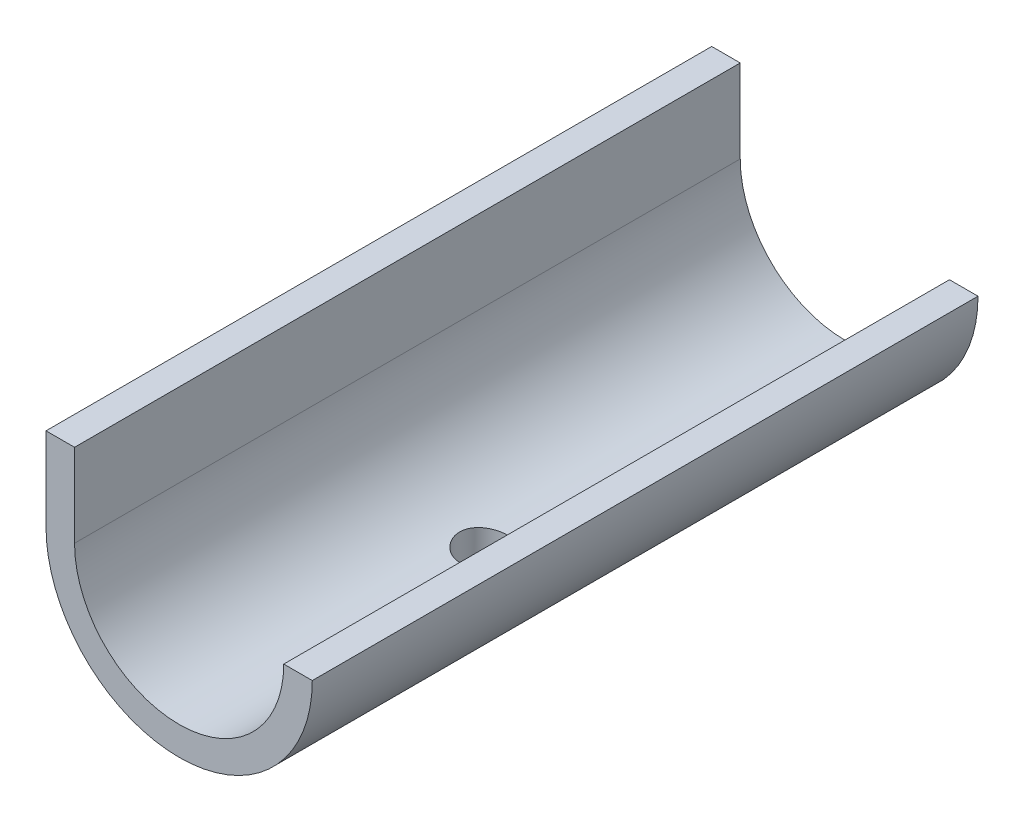
ISO-10303-21;
HEADER;
FILE_DESCRIPTION(('STEP AP214'),'2;1');
FILE_NAME('part.step','',(''),(''),'','','');
FILE_SCHEMA(('AUTOMOTIVE_DESIGN { 1 0 10303 214 1 1 1 1 }'));
ENDSEC;
DATA;
#1=APPLICATION_CONTEXT('core data for automotive mechanical design processes');
#2=APPLICATION_PROTOCOL_DEFINITION('international standard','automotive_design',2000,#1);
#3=PRODUCT_CONTEXT('',#1,'mechanical');
#4=PRODUCT('Part','Part','',(#3));
#5=PRODUCT_RELATED_PRODUCT_CATEGORY('part','',(#4));
#6=PRODUCT_DEFINITION_FORMATION('','',#4);
#7=PRODUCT_DEFINITION_CONTEXT('part definition',#1,'design');
#8=PRODUCT_DEFINITION('design','',#6,#7);
#9=PRODUCT_DEFINITION_SHAPE('','',#8);
#10=(LENGTH_UNIT() NAMED_UNIT(*) SI_UNIT(.MILLI.,.METRE.));
#11=(NAMED_UNIT(*) PLANE_ANGLE_UNIT() SI_UNIT($,.RADIAN.));
#12=(NAMED_UNIT(*) SI_UNIT($,.STERADIAN.) SOLID_ANGLE_UNIT());
#13=UNCERTAINTY_MEASURE_WITH_UNIT(LENGTH_MEASURE(1.E-05),#10,'distance_accuracy_value','');
#14=(GEOMETRIC_REPRESENTATION_CONTEXT(3) GLOBAL_UNCERTAINTY_ASSIGNED_CONTEXT((#13)) GLOBAL_UNIT_ASSIGNED_CONTEXT((#10,
#11,#12)) REPRESENTATION_CONTEXT('',''));
#15=CARTESIAN_POINT('',(0.,0.,0.));
#16=DIRECTION('',(0.,0.,1.));
#17=DIRECTION('',(1.,0.,0.));
#18=AXIS2_PLACEMENT_3D('',#15,#16,#17);
#19=CARTESIAN_POINT('',(0.,0.,70.));
#20=DIRECTION('',(0.,0.,-1.));
#21=DIRECTION('',(-1.,0.,0.));
#22=AXIS2_PLACEMENT_3D('',#19,#20,#21);
#23=CYLINDRICAL_SURFACE('',#22,14.);
#24=CARTESIAN_POINT('',(0.,-14.,40.5));
#25=CARTESIAN_POINT('',(0.139239584884693,-13.9999975279519,40.4999945573978));
#26=CARTESIAN_POINT('',(0.278551398798769,-13.9979012185717,40.4883280975497));
#27=CARTESIAN_POINT('',(0.553257461551452,-13.9897405917584,40.4419958336177));
#28=CARTESIAN_POINT('',(0.688648164109868,-13.9836727927304,40.4073098491621));
#29=CARTESIAN_POINT('',(0.951498716003348,-13.9682487550673,40.316027766762));
#30=CARTESIAN_POINT('',(1.07896532023463,-13.9588953637627,40.2594506356316));
#31=CARTESIAN_POINT('',(1.32258294398845,-13.9379246329878,40.1260443117829));
#32=CARTESIAN_POINT('',(1.43873504418376,-13.9263075100501,40.0492170558005));
#33=CARTESIAN_POINT('',(1.65770744324836,-13.9019523246795,39.8766007869825));
#34=CARTESIAN_POINT('',(1.76038642030699,-13.8892044205267,39.7806338701291));
#35=CARTESIAN_POINT('',(1.94827611327337,-13.8640984861177,39.5728452504625));
#36=CARTESIAN_POINT('',(2.03348564380398,-13.851740482366,39.4610224726311));
#37=CARTESIAN_POINT('',(2.18459604528548,-13.828718102426,39.2237098828865));
#38=CARTESIAN_POINT('',(2.2503549193704,-13.8180664295287,39.098128313076));
#39=CARTESIAN_POINT('',(2.35978878168925,-13.799800524336,38.8374788413355));
#40=CARTESIAN_POINT('',(2.40346549014524,-13.7921860554493,38.7024116792762));
#41=CARTESIAN_POINT('',(2.46704527057167,-13.7809553111512,38.4281311785852));
#42=CARTESIAN_POINT('',(2.48719373563912,-13.7772977959189,38.2889764448584));
#43=CARTESIAN_POINT('',(2.50390640595675,-13.7742705702387,38.0092170779927));
#44=CARTESIAN_POINT('',(2.5004725277955,-13.7749005113397,37.8686125636079));
#45=CARTESIAN_POINT('',(2.47031736473549,-13.78033942777,37.5917111025635));
#46=CARTESIAN_POINT('',(2.44387361595034,-13.7850985960022,37.4553828097458));
#47=CARTESIAN_POINT('',(2.3688857538611,-13.7981816164894,37.1891293635014));
#48=CARTESIAN_POINT('',(2.3203407810603,-13.8065056073765,37.0592044593146));
#49=CARTESIAN_POINT('',(2.2022526779638,-13.8258332062344,36.8086255211308));
#50=CARTESIAN_POINT('',(2.13259607876041,-13.836851230427,36.6880261183911));
#51=CARTESIAN_POINT('',(1.97434240206301,-13.8603157063341,36.4601224977845));
#52=CARTESIAN_POINT('',(1.8857435758047,-13.8727622898853,36.3528195089008));
#53=CARTESIAN_POINT('',(1.69061708906588,-13.8978993100277,36.1529497822127));
#54=CARTESIAN_POINT('',(1.58385171151662,-13.9105906924877,36.0606150820204));
#55=CARTESIAN_POINT('',(1.35622200140277,-13.934623736005,35.895133867092));
#56=CARTESIAN_POINT('',(1.23535755129116,-13.9459653858077,35.8219875123497));
#57=CARTESIAN_POINT('',(0.98272912541029,-13.9660408385903,35.6969309763037));
#58=CARTESIAN_POINT('',(0.850953766692503,-13.9747718731006,35.6450433177021));
#59=CARTESIAN_POINT('',(0.58036740103594,-13.9886206199705,35.564203117808));
#60=CARTESIAN_POINT('',(0.441557072364819,-13.9937386799627,35.5352483699271));
#61=CARTESIAN_POINT('',(0.162838985381711,-13.999737506353,35.501415153955));
#62=CARTESIAN_POINT('',(0.0229710170574318,-14.0006742692249,35.4962184914519));
#63=CARTESIAN_POINT('',(-0.255635962261019,-13.9983590537919,35.5091977397633));
#64=CARTESIAN_POINT('',(-0.394375023096462,-13.9951072614327,35.5273726130279));
#65=CARTESIAN_POINT('',(-0.665788309880041,-13.9848150834562,35.5863143984903));
#66=CARTESIAN_POINT('',(-0.798498270193177,-13.9778014506051,35.6269218392178));
#67=CARTESIAN_POINT('',(-1.05522666669471,-13.960768732277,35.7294046301854));
#68=CARTESIAN_POINT('',(-1.17924455600831,-13.9507494579045,35.7912813171688));
#69=CARTESIAN_POINT('',(-1.4164370995142,-13.9286773386827,35.9352612229124));
#70=CARTESIAN_POINT('',(-1.52949072853056,-13.9166051337771,36.0175607915398));
#71=CARTESIAN_POINT('',(-1.74029662989027,-13.8918196803142,36.1997826510615));
#72=CARTESIAN_POINT('',(-1.8380476135904,-13.8791063778887,36.2997064245934));
#73=CARTESIAN_POINT('',(-2.01666949257316,-13.8542878912599,36.5157749692476));
#74=CARTESIAN_POINT('',(-2.09732417121668,-13.8421918152179,36.6320997008671));
#75=CARTESIAN_POINT('',(-2.237948270774,-13.8201546664427,36.8768336894488));
#76=CARTESIAN_POINT('',(-2.29791841370414,-13.8102135184939,37.0052425244028));
#77=CARTESIAN_POINT('',(-2.39515706197428,-13.7936819036385,37.2699261748407));
#78=CARTESIAN_POINT('',(-2.43252842924636,-13.7870762776017,37.4061622108181));
#79=CARTESIAN_POINT('',(-2.48382895891452,-13.7779274424092,37.6831072951462));
#80=CARTESIAN_POINT('',(-2.49776049425864,-13.7753838220348,37.8238158892447));
#81=CARTESIAN_POINT('',(-2.50171229780527,-13.7746664843416,38.1035492089015));
#82=CARTESIAN_POINT('',(-2.49207328035334,-13.7764304992774,38.2425690771419));
#83=CARTESIAN_POINT('',(-2.44989946243099,-13.7839923104721,38.5169738180181));
#84=CARTESIAN_POINT('',(-2.41736476961371,-13.7897900877646,38.6523587077421));
#85=CARTESIAN_POINT('',(-2.3304611386535,-13.8047410588042,38.9154898760334));
#86=CARTESIAN_POINT('',(-2.27612576514716,-13.8138890925692,39.0432475517861));
#87=CARTESIAN_POINT('',(-2.14719934056736,-13.8345140264404,39.2878884394367));
#88=CARTESIAN_POINT('',(-2.07260704454505,-13.8459910696717,39.4047709823784));
#89=CARTESIAN_POINT('',(-1.90408567428783,-13.8701759776461,39.62605704739));
#90=CARTESIAN_POINT('',(-1.80990741155503,-13.8828984590281,39.7302692317432));
#91=CARTESIAN_POINT('',(-1.60540999726032,-13.9080282435319,39.9215258059662));
#92=CARTESIAN_POINT('',(-1.49508713803928,-13.920435473485,40.0085662414773));
#93=CARTESIAN_POINT('',(-1.26037074660264,-13.9436534678806,40.1636577677888));
#94=CARTESIAN_POINT('',(-1.13587103767058,-13.9544505684285,40.2315502593916));
#95=CARTESIAN_POINT('',(-0.87708484019048,-13.9730987112511,40.3453492032927));
#96=CARTESIAN_POINT('',(-0.742807935956544,-13.9809525934581,40.3912768614976));
#97=CARTESIAN_POINT('',(-0.50673175549175,-13.9911779735748,40.4502306133961));
#98=CARTESIAN_POINT('',(-0.406334867671671,-13.9944679971863,40.4688631369367));
#99=CARTESIAN_POINT('',(-0.20397155203894,-13.9988798925243,40.4937496904037));
#100=CARTESIAN_POINT('',(-0.102005158109662,-14.0000018109911,40.5000039871815));
#101=CARTESIAN_POINT('',(0.,-14.,40.5));
#102=B_SPLINE_CURVE_WITH_KNOTS('',3,(#24,#25,#26,#27,#28,#29,#30,#31,#32,#33,#34,#35,#36,#37,
#38,#39,#40,#41,#42,#43,#44,#45,#46,#47,#48,#49,#50,#51,#52,#53,#54,#55,#56,#57,#58,#59,#60,#61,
#62,#63,#64,#65,#66,#67,#68,#69,#70,#71,#72,#73,#74,#75,#76,#77,#78,#79,#80,#81,#82,#83,#84,#85,
#86,#87,#88,#89,#90,#91,#92,#93,#94,#95,#96,#97,#98,#99,#100,#101),.UNSPECIFIED.,.T.,.F.,(4,2,2,
2,2,2,2,2,2,2,2,2,2,2,2,2,2,2,2,2,2,2,2,2,2,2,2,2,2,2,2,2,2,2,2,2,2,2,4),(0.,0.417345796741632,
0.835057949374028,1.25240899749005,1.66972014433903,2.09110796789027,2.51252437496281,
2.93694536469338,3.36133328652202,3.78125426758826,4.20114112116258,4.61603258426602,
5.03094018350355,5.44811857395105,5.86533549534551,6.28850377891476,6.71167559078143,
7.13529458336168,7.55887281066885,7.97676106621615,8.39463077078322,8.80956740145244,
9.22453011509512,9.64364840488133,10.062801969859,10.4869762077789,10.9111356379344,
11.3333496148672,11.7555208460958,12.1716257235315,12.5877286444974,13.0031933708605,
13.4186836366131,13.8398246877353,14.2610626074926,14.6856934454013,15.109913492521,
15.4156623340469,15.7214045841282),.UNSPECIFIED.);
#103=CARTESIAN_POINT('',(0.,-14.,40.5));
#104=VERTEX_POINT('',#103);
#105=EDGE_CURVE('E119',#104,#104,#102,.T.);
#106=ORIENTED_EDGE('',*,*,#105,.T.);
#107=EDGE_LOOP('',(#106));
#108=FACE_BOUND('',#107,.T.);
#109=CARTESIAN_POINT('',(0.,0.,70.));
#110=DIRECTION('',(0.,0.,1.));
#111=DIRECTION('',(1.,0.,0.));
#112=AXIS2_PLACEMENT_3D('',#109,#110,#111);
#113=CIRCLE('',#112,14.);
#114=CARTESIAN_POINT('',(-14.,0.,70.));
#115=VERTEX_POINT('',#114);
#116=CARTESIAN_POINT('',(14.,0.,70.));
#117=VERTEX_POINT('',#116);
#118=EDGE_CURVE('E141',#115,#117,#113,.T.);
#119=ORIENTED_EDGE('',*,*,#118,.F.);
#120=DIRECTION('',(0.,0.,-1.));
#121=VECTOR('',#120,1.);
#122=CARTESIAN_POINT('',(-14.,0.,70.));
#123=LINE('',#122,#121);
#124=CARTESIAN_POINT('',(-14.,0.,0.));
#125=VERTEX_POINT('',#124);
#126=EDGE_CURVE('E133',#115,#125,#123,.T.);
#127=ORIENTED_EDGE('',*,*,#126,.T.);
#128=CARTESIAN_POINT('',(0.,0.,0.));
#129=DIRECTION('',(0.,0.,1.));
#130=DIRECTION('',(1.,0.,0.));
#131=AXIS2_PLACEMENT_3D('',#128,#129,#130);
#132=CIRCLE('',#131,14.);
#133=CARTESIAN_POINT('',(14.,0.,0.));
#134=VERTEX_POINT('',#133);
#135=EDGE_CURVE('E111',#125,#134,#132,.T.);
#136=ORIENTED_EDGE('',*,*,#135,.T.);
#137=DIRECTION('',(0.,0.,-1.));
#138=VECTOR('',#137,1.);
#139=CARTESIAN_POINT('',(14.,0.,70.));
#140=LINE('',#139,#138);
#141=EDGE_CURVE('E58',#134,#117,#140,.F.);
#142=ORIENTED_EDGE('',*,*,#141,.T.);
#143=EDGE_LOOP('',(#119,#127,#136,#142));
#144=FACE_BOUND('',#143,.T.);
#145=ADVANCED_FACE('F33',(#108,#144),#23,.T.);
#146=CARTESIAN_POINT('',(0.,0.,70.));
#147=DIRECTION('',(0.,0.,1.));
#148=DIRECTION('',(1.,0.,0.));
#149=AXIS2_PLACEMENT_3D('',#146,#147,#148);
#150=PLANE('',#149);
#151=CARTESIAN_POINT('',(0.,0.,70.));
#152=DIRECTION('',(0.,0.,1.));
#153=DIRECTION('',(1.,0.,0.));
#154=AXIS2_PLACEMENT_3D('',#151,#152,#153);
#155=CIRCLE('',#154,11.);
#156=CARTESIAN_POINT('',(-11.,0.,70.));
#157=VERTEX_POINT('',#156);
#158=CARTESIAN_POINT('',(11.,0.,70.));
#159=VERTEX_POINT('',#158);
#160=EDGE_CURVE('E135',#157,#159,#155,.T.);
#161=ORIENTED_EDGE('',*,*,#160,.F.);
#162=DIRECTION('',(0.,1.,0.));
#163=VECTOR('',#162,1.);
#164=CARTESIAN_POINT('',(-11.,0.,70.));
#165=LINE('',#164,#163);
#166=CARTESIAN_POINT('',(-11.,8.74076907527716,70.));
#167=VERTEX_POINT('',#166);
#168=EDGE_CURVE('E114',#157,#167,#165,.T.);
#169=ORIENTED_EDGE('',*,*,#168,.T.);
#170=DIRECTION('',(-1.,0.,0.));
#171=VECTOR('',#170,1.);
#172=CARTESIAN_POINT('',(-11.,8.74076907527716,70.));
#173=LINE('',#172,#171);
#174=CARTESIAN_POINT('',(-14.,8.74076907527716,70.));
#175=VERTEX_POINT('',#174);
#176=EDGE_CURVE('E125',#167,#175,#173,.T.);
#177=ORIENTED_EDGE('',*,*,#176,.T.);
#178=DIRECTION('',(0.,-1.,0.));
#179=VECTOR('',#178,1.);
#180=CARTESIAN_POINT('',(-14.,8.74076907527716,70.));
#181=LINE('',#180,#179);
#182=EDGE_CURVE('E95',#175,#115,#181,.T.);
#183=ORIENTED_EDGE('',*,*,#182,.T.);
#184=ORIENTED_EDGE('',*,*,#118,.T.);
#185=DIRECTION('',(1.,0.,0.));
#186=VECTOR('',#185,1.);
#187=CARTESIAN_POINT('',(-16.0293682697394,0.,70.));
#188=LINE('',#187,#186);
#189=EDGE_CURVE('E128',#159,#117,#188,.T.);
#190=ORIENTED_EDGE('',*,*,#189,.F.);
#191=EDGE_LOOP('',(#161,#169,#177,#183,#184,#190));
#192=FACE_BOUND('',#191,.T.);
#193=ADVANCED_FACE('F153',(#192),#150,.T.);
#194=CARTESIAN_POINT('',(0.,0.,0.));
#195=DIRECTION('',(0.,0.,1.));
#196=DIRECTION('',(1.,0.,0.));
#197=AXIS2_PLACEMENT_3D('',#194,#195,#196);
#198=PLANE('',#197);
#199=ORIENTED_EDGE('',*,*,#135,.F.);
#200=DIRECTION('',(0.,-1.,0.));
#201=VECTOR('',#200,1.);
#202=CARTESIAN_POINT('',(-14.,8.74076907527716,0.));
#203=LINE('',#202,#201);
#204=CARTESIAN_POINT('',(-14.,8.74076907527716,0.));
#205=VERTEX_POINT('',#204);
#206=EDGE_CURVE('E93',#205,#125,#203,.T.);
#207=ORIENTED_EDGE('',*,*,#206,.F.);
#208=DIRECTION('',(-1.,0.,0.));
#209=VECTOR('',#208,1.);
#210=CARTESIAN_POINT('',(-11.,8.74076907527716,0.));
#211=LINE('',#210,#209);
#212=CARTESIAN_POINT('',(-11.,8.74076907527716,0.));
#213=VERTEX_POINT('',#212);
#214=EDGE_CURVE('E108',#213,#205,#211,.T.);
#215=ORIENTED_EDGE('',*,*,#214,.F.);
#216=DIRECTION('',(0.,1.,0.));
#217=VECTOR('',#216,1.);
#218=CARTESIAN_POINT('',(-11.,0.,0.));
#219=LINE('',#218,#217);
#220=CARTESIAN_POINT('',(-11.,0.,0.));
#221=VERTEX_POINT('',#220);
#222=EDGE_CURVE('E101',#221,#213,#219,.T.);
#223=ORIENTED_EDGE('',*,*,#222,.F.);
#224=CARTESIAN_POINT('',(0.,0.,0.));
#225=DIRECTION('',(0.,0.,1.));
#226=DIRECTION('',(1.,0.,0.));
#227=AXIS2_PLACEMENT_3D('',#224,#225,#226);
#228=CIRCLE('',#227,11.);
#229=CARTESIAN_POINT('',(11.,0.,0.));
#230=VERTEX_POINT('',#229);
#231=EDGE_CURVE('E136',#221,#230,#228,.T.);
#232=ORIENTED_EDGE('',*,*,#231,.T.);
#233=DIRECTION('',(1.,0.,0.));
#234=VECTOR('',#233,1.);
#235=CARTESIAN_POINT('',(-16.0293682697394,0.,0.));
#236=LINE('',#235,#234);
#237=EDGE_CURVE('E54',#230,#134,#236,.T.);
#238=ORIENTED_EDGE('',*,*,#237,.T.);
#239=EDGE_LOOP('',(#199,#207,#215,#223,#232,#238));
#240=FACE_BOUND('',#239,.T.);
#241=ADVANCED_FACE('F106',(#240),#198,.F.);
#242=CARTESIAN_POINT('',(0.,0.,0.));
#243=DIRECTION('',(0.,0.,1.));
#244=DIRECTION('',(1.,0.,0.));
#245=AXIS2_PLACEMENT_3D('',#242,#243,#244);
#246=CYLINDRICAL_SURFACE('',#245,11.);
#247=CARTESIAN_POINT('',(0.,-11.,40.5));
#248=CARTESIAN_POINT('',(-0.138518278596905,-10.9999974735185,40.4999954681736));
#249=CARTESIAN_POINT('',(-0.27709017225801,-10.9973570934613,40.4884487724231));
#250=CARTESIAN_POINT('',(-0.550288594599325,-10.987079320306,40.4426205239383));
#251=CARTESIAN_POINT('',(-0.684912392220731,-10.9794385496265,40.4083236040447));
#252=CARTESIAN_POINT('',(-0.946227671984919,-10.9600095312294,40.3181319513681));
#253=CARTESIAN_POINT('',(-1.07292759495648,-10.9482257885674,40.2622606720193));
#254=CARTESIAN_POINT('',(-1.31515227582567,-10.921778201627,40.1305828866191));
#255=CARTESIAN_POINT('',(-1.43067714503183,-10.9071143860398,40.0547765791576));
#256=CARTESIAN_POINT('',(-1.64926760444638,-10.8762265816814,39.8839979553933));
#257=CARTESIAN_POINT('',(-1.75211293892049,-10.8599819758326,39.788747426525));
#258=CARTESIAN_POINT('',(-1.94051389816611,-10.827906511833,39.5823810258628));
#259=CARTESIAN_POINT('',(-2.02606788121784,-10.8120756930933,39.4712636493055));
#260=CARTESIAN_POINT('',(-2.17844599401787,-10.7824158369221,39.2346679447163));
#261=CARTESIAN_POINT('',(-2.24503254356576,-10.7686131580577,39.1090330036942));
#262=CARTESIAN_POINT('',(-2.3560606971787,-10.7448696147509,38.8479904994184));
#263=CARTESIAN_POINT('',(-2.40050517717749,-10.7349282488168,38.7125842079384));
#264=CARTESIAN_POINT('',(-2.46525349412719,-10.7202434469831,38.4382408128835));
#265=CARTESIAN_POINT('',(-2.48594892680754,-10.715415797339,38.2994007368775));
#266=CARTESIAN_POINT('',(-2.50382988451487,-10.7112523406768,38.0201417727869));
#267=CARTESIAN_POINT('',(-2.50101853886553,-10.711915802658,37.8797230973377));
#268=CARTESIAN_POINT('',(-2.47228016958763,-10.7185835035919,37.6042271166513));
#269=CARTESIAN_POINT('',(-2.44681104599438,-10.7244819412976,37.4690990938051));
#270=CARTESIAN_POINT('',(-2.37420684920502,-10.7407873672743,37.2050855138452));
#271=CARTESIAN_POINT('',(-2.32707047404289,-10.7511946264744,37.0762003323728));
#272=CARTESIAN_POINT('',(-2.21205734402544,-10.7754474384537,36.8270593281895));
#273=CARTESIAN_POINT('',(-2.14400712086008,-10.7893215597825,36.7068864822363));
#274=CARTESIAN_POINT('',(-1.98921977920408,-10.8189276843241,36.4794974468889));
#275=CARTESIAN_POINT('',(-1.90247992237135,-10.8346599596346,36.3722831597361));
#276=CARTESIAN_POINT('',(-1.71036518003517,-10.8666615287251,36.171221438179));
#277=CARTESIAN_POINT('',(-1.60460166742828,-10.882934773515,36.0777455734836));
#278=CARTESIAN_POINT('',(-1.37871229840972,-10.9138502597158,35.9097941112929));
#279=CARTESIAN_POINT('',(-1.2585861400908,-10.9284924668293,35.8353189133005));
#280=CARTESIAN_POINT('',(-1.00690799179915,-10.9545497424637,35.7073796120285));
#281=CARTESIAN_POINT('',(-0.875328834348157,-10.9659568484873,35.6539672263777));
#282=CARTESIAN_POINT('',(-0.604745122491697,-10.9841998956698,35.5701159941321));
#283=CARTESIAN_POINT('',(-0.465741739663719,-10.9910365557784,35.5396735341778));
#284=CARTESIAN_POINT('',(-0.187439840192731,-10.9992650071756,35.5031737625273));
#285=CARTESIAN_POINT('',(-0.0482110923370365,-11.0007700184113,35.4966093086833));
#286=CARTESIAN_POINT('',(0.229353886680105,-10.9984842255063,35.5066730398529));
#287=CARTESIAN_POINT('',(0.36769018272086,-10.9946938107912,35.523299519406));
#288=CARTESIAN_POINT('',(0.637841677218462,-10.9823148103741,35.5788531669054));
#289=CARTESIAN_POINT('',(0.76971503681443,-10.973784087055,35.6175115464437));
#290=CARTESIAN_POINT('',(1.02510393087761,-10.9528806132367,35.7157310274571));
#291=CARTESIAN_POINT('',(1.14861871432289,-10.9405075180554,35.7752940042533));
#292=CARTESIAN_POINT('',(1.38586085256056,-10.9130143275095,35.9146691435553));
#293=CARTESIAN_POINT('',(1.4994106852272,-10.8978552985532,35.9947756267732));
#294=CARTESIAN_POINT('',(1.71163773579052,-10.866546095646,36.1725793284402));
#295=CARTESIAN_POINT('',(1.8103128535797,-10.8503957821912,36.2702790265468));
#296=CARTESIAN_POINT('',(1.99201706218096,-10.8185287714487,36.4828309651334));
#297=CARTESIAN_POINT('',(2.07469366594062,-10.8028272119253,36.5979872417868));
#298=CARTESIAN_POINT('',(2.21953814406553,-10.7740023321604,36.8408463906703));
#299=CARTESIAN_POINT('',(2.28170692501017,-10.7608788979592,36.9685487079596));
#300=CARTESIAN_POINT('',(2.38333597241928,-10.7388274870674,37.2321804695689));
#301=CARTESIAN_POINT('',(2.42292716221705,-10.7298753781702,37.3680573237434));
#302=CARTESIAN_POINT('',(2.47865258340365,-10.7171411058581,37.6447669066991));
#303=CARTESIAN_POINT('',(2.49479091341614,-10.7133580391079,37.7855987651364));
#304=CARTESIAN_POINT('',(2.50296739214165,-10.7114502943222,38.0646586193109));
#305=CARTESIAN_POINT('',(2.49556548501071,-10.7131941458177,38.2028695993336));
#306=CARTESIAN_POINT('',(2.45813115403283,-10.7218446846914,38.4760189101883));
#307=CARTESIAN_POINT('',(2.42809904217009,-10.7287513008948,38.6109572861105));
#308=CARTESIAN_POINT('',(2.34653692360609,-10.7468826027048,38.8732433973663));
#309=CARTESIAN_POINT('',(2.29509457527995,-10.758089666867,39.0006196911415));
#310=CARTESIAN_POINT('',(2.1722453660688,-10.783564723281,39.2450147069006));
#311=CARTESIAN_POINT('',(2.10083623731223,-10.7978330631966,39.3620322503255));
#312=CARTESIAN_POINT('',(1.93824996891049,-10.828211072634,39.5851344276553));
#313=CARTESIAN_POINT('',(1.84667645642834,-10.8443540558786,39.6909257222074));
#314=CARTESIAN_POINT('',(1.64715628932418,-10.8764454859305,39.885823185082));
#315=CARTESIAN_POINT('',(1.53920583540676,-10.8923938866665,39.974925470966));
#316=CARTESIAN_POINT('',(1.30814060515057,-10.9225693389041,40.1351380602337));
#317=CARTESIAN_POINT('',(1.1848316218762,-10.9367686161711,40.2059738233331));
#318=CARTESIAN_POINT('',(0.92775596771169,-10.9615640551399,40.325799970663));
#319=CARTESIAN_POINT('',(0.793997844337695,-10.9721631246672,40.3748079947867));
#320=CARTESIAN_POINT('',(0.550163071539621,-10.9867559512784,40.4412279061761));
#321=CARTESIAN_POINT('',(0.441368111138488,-10.9916908558499,40.4632239876893));
#322=CARTESIAN_POINT('',(0.221726814930916,-10.9983138080738,40.4926114735793));
#323=CARTESIAN_POINT('',(0.110880584717101,-11.0000020223883,40.5000036276192));
#324=CARTESIAN_POINT('',(0.,-11.,40.5));
#325=B_SPLINE_CURVE_WITH_KNOTS('',3,(#247,#248,#249,#250,#251,#252,#253,#254,#255,#256,#257,
#258,#259,#260,#261,#262,#263,#264,#265,#266,#267,#268,#269,#270,#271,#272,#273,#274,#275,#276,
#277,#278,#279,#280,#281,#282,#283,#284,#285,#286,#287,#288,#289,#290,#291,#292,#293,#294,#295,
#296,#297,#298,#299,#300,#301,#302,#303,#304,#305,#306,#307,#308,#309,#310,#311,#312,#313,#314,
#315,#316,#317,#318,#319,#320,#321,#322,#323,#324),.UNSPECIFIED.,.T.,.F.,(4,2,2,2,2,2,2,2,2,2,2,
2,2,2,2,2,2,2,2,2,2,2,2,2,2,2,2,2,2,2,2,2,2,2,2,2,2,2,4),(0.,0.415148849633318,
0.830578406996931,1.24555761755319,1.66053269430525,2.08192389396809,2.50335508365804,
2.92985362973415,3.35629676538239,3.77560244898082,4.19485231368758,4.60581714174235,
5.01680666753971,5.43130157438851,5.84585725297979,6.27011531803704,6.69438230269864,
7.11968464096648,7.54492006169896,7.96106941916763,8.37718817463628,8.78833576149037,
9.19952024123084,9.61696129328769,10.0344612272568,10.460313215404,10.8861463755948,
11.3094844190899,11.732748471094,12.1460204395146,12.5592867105954,12.9708773657615,
13.382514789318,13.8031102578591,14.2238034502007,14.6504927745347,15.0768366452216,
15.4091704772436,15.74148724914),.UNSPECIFIED.);
#326=CARTESIAN_POINT('',(0.,-11.,40.5));
#327=VERTEX_POINT('',#326);
#328=EDGE_CURVE('E37',#327,#327,#325,.T.);
#329=ORIENTED_EDGE('',*,*,#328,.T.);
#330=EDGE_LOOP('',(#329));
#331=FACE_BOUND('',#330,.T.);
#332=ORIENTED_EDGE('',*,*,#160,.T.);
#333=DIRECTION('',(0.,0.,1.));
#334=VECTOR('',#333,1.);
#335=CARTESIAN_POINT('',(11.,0.,0.));
#336=LINE('',#335,#334);
#337=EDGE_CURVE('E11',#159,#230,#336,.F.);
#338=ORIENTED_EDGE('',*,*,#337,.T.);
#339=ORIENTED_EDGE('',*,*,#231,.F.);
#340=DIRECTION('',(0.,0.,1.));
#341=VECTOR('',#340,1.);
#342=CARTESIAN_POINT('',(-11.,0.,0.));
#343=LINE('',#342,#341);
#344=EDGE_CURVE('E47',#221,#157,#343,.T.);
#345=ORIENTED_EDGE('',*,*,#344,.T.);
#346=EDGE_LOOP('',(#332,#338,#339,#345));
#347=FACE_BOUND('',#346,.T.);
#348=ADVANCED_FACE('F149',(#331,#347),#246,.F.);
#349=CARTESIAN_POINT('',(-16.0293682697394,0.,0.));
#350=DIRECTION('',(0.,-1.,0.));
#351=DIRECTION('',(0.,0.,-1.));
#352=AXIS2_PLACEMENT_3D('',#349,#350,#351);
#353=PLANE('',#352);
#354=ORIENTED_EDGE('',*,*,#237,.F.);
#355=ORIENTED_EDGE('',*,*,#337,.F.);
#356=ORIENTED_EDGE('',*,*,#189,.T.);
#357=ORIENTED_EDGE('',*,*,#141,.F.);
#358=EDGE_LOOP('',(#354,#355,#356,#357));
#359=FACE_BOUND('',#358,.T.);
#360=ADVANCED_FACE('F155',(#359),#353,.F.);
#361=CARTESIAN_POINT('',(-11.,8.74076907527716,0.));
#362=DIRECTION('',(0.,1.,0.));
#363=DIRECTION('',(0.,0.,1.));
#364=AXIS2_PLACEMENT_3D('',#361,#362,#363);
#365=PLANE('',#364);
#366=ORIENTED_EDGE('',*,*,#176,.F.);
#367=DIRECTION('',(0.,0.,1.));
#368=VECTOR('',#367,1.);
#369=CARTESIAN_POINT('',(-11.,8.74076907527716,0.));
#370=LINE('',#369,#368);
#371=EDGE_CURVE('E100',#213,#167,#370,.T.);
#372=ORIENTED_EDGE('',*,*,#371,.F.);
#373=ORIENTED_EDGE('',*,*,#214,.T.);
#374=DIRECTION('',(0.,0.,1.));
#375=VECTOR('',#374,1.);
#376=CARTESIAN_POINT('',(-14.,8.74076907527716,0.));
#377=LINE('',#376,#375);
#378=EDGE_CURVE('E89',#205,#175,#377,.T.);
#379=ORIENTED_EDGE('',*,*,#378,.T.);
#380=EDGE_LOOP('',(#366,#372,#373,#379));
#381=FACE_BOUND('',#380,.T.);
#382=ADVANCED_FACE('F113',(#381),#365,.T.);
#383=CARTESIAN_POINT('',(-11.,0.,0.));
#384=DIRECTION('',(1.,0.,0.));
#385=DIRECTION('',(0.,0.,-1.));
#386=AXIS2_PLACEMENT_3D('',#383,#384,#385);
#387=PLANE('',#386);
#388=ORIENTED_EDGE('',*,*,#168,.F.);
#389=ORIENTED_EDGE('',*,*,#344,.F.);
#390=ORIENTED_EDGE('',*,*,#222,.T.);
#391=ORIENTED_EDGE('',*,*,#371,.T.);
#392=EDGE_LOOP('',(#388,#389,#390,#391));
#393=FACE_BOUND('',#392,.T.);
#394=ADVANCED_FACE('F151',(#393),#387,.T.);
#395=CARTESIAN_POINT('',(-14.,8.74076907527716,0.));
#396=DIRECTION('',(-1.,0.,0.));
#397=DIRECTION('',(0.,-1.,0.));
#398=AXIS2_PLACEMENT_3D('',#395,#396,#397);
#399=PLANE('',#398);
#400=ORIENTED_EDGE('',*,*,#182,.F.);
#401=ORIENTED_EDGE('',*,*,#378,.F.);
#402=ORIENTED_EDGE('',*,*,#206,.T.);
#403=ORIENTED_EDGE('',*,*,#126,.F.);
#404=EDGE_LOOP('',(#400,#401,#402,#403));
#405=FACE_BOUND('',#404,.T.);
#406=ADVANCED_FACE('F91',(#405),#399,.T.);
#407=CARTESIAN_POINT('',(0.,-14.,38.));
#408=DIRECTION('',(0.,1.,0.));
#409=DIRECTION('',(0.,0.,1.));
#410=AXIS2_PLACEMENT_3D('',#407,#408,#409);
#411=CYLINDRICAL_SURFACE('',#410,2.5);
#412=ORIENTED_EDGE('',*,*,#328,.F.);
#413=EDGE_LOOP('',(#412));
#414=FACE_BOUND('',#413,.T.);
#415=ORIENTED_EDGE('',*,*,#105,.F.);
#416=EDGE_LOOP('',(#415));
#417=FACE_BOUND('',#416,.T.);
#418=ADVANCED_FACE('F172',(#414,#417),#411,.F.);
#419=CLOSED_SHELL('',(#145,#193,#241,#348,#360,#382,#394,#406,#418));
#420=MANIFOLD_SOLID_BREP('B2',#419);
#421=ADVANCED_BREP_SHAPE_REPRESENTATION('',(#18,#420),#14);
#422=SHAPE_DEFINITION_REPRESENTATION(#9,#421);
ENDSEC;
END-ISO-10303-21;
